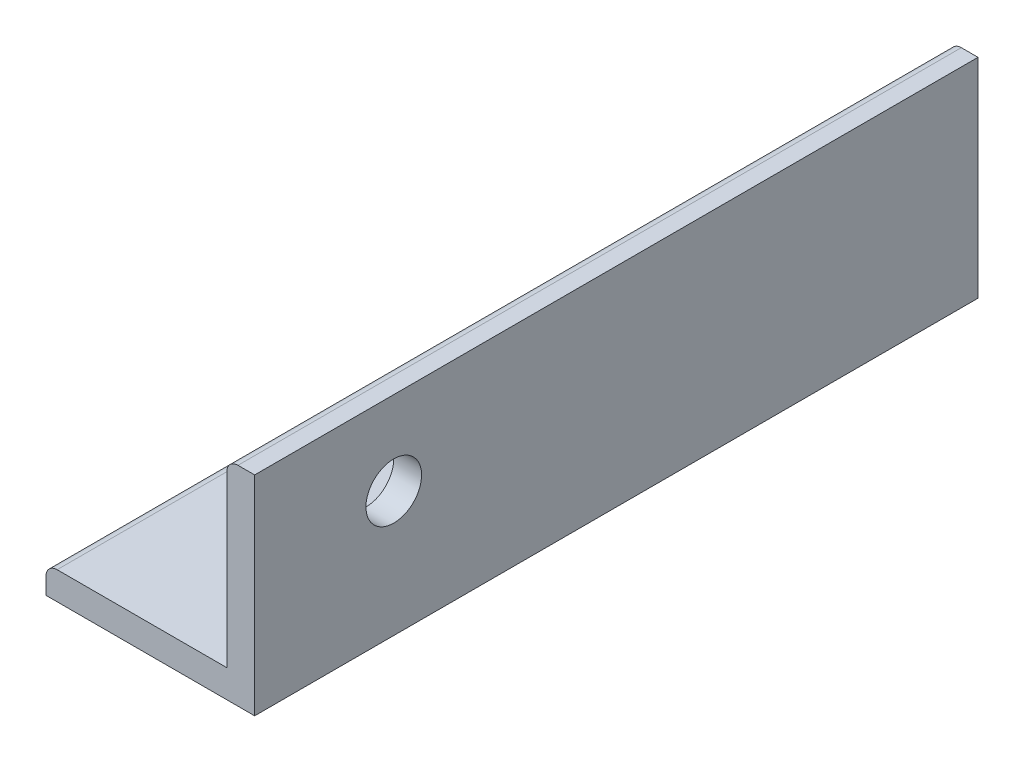
ISO-10303-21;
HEADER;
FILE_DESCRIPTION(('STEP AP214'),'2;1');
FILE_NAME('part.step','',(''),(''),'','','');
FILE_SCHEMA(('AUTOMOTIVE_DESIGN { 1 0 10303 214 1 1 1 1 }'));
ENDSEC;
DATA;
#1=APPLICATION_CONTEXT('core data for automotive mechanical design processes');
#2=APPLICATION_PROTOCOL_DEFINITION('international standard','automotive_design',2000,#1);
#3=PRODUCT_CONTEXT('',#1,'mechanical');
#4=PRODUCT('Part','Part','',(#3));
#5=PRODUCT_RELATED_PRODUCT_CATEGORY('part','',(#4));
#6=PRODUCT_DEFINITION_FORMATION('','',#4);
#7=PRODUCT_DEFINITION_CONTEXT('part definition',#1,'design');
#8=PRODUCT_DEFINITION('design','',#6,#7);
#9=PRODUCT_DEFINITION_SHAPE('','',#8);
#10=(LENGTH_UNIT() NAMED_UNIT(*) SI_UNIT(.MILLI.,.METRE.));
#11=(NAMED_UNIT(*) PLANE_ANGLE_UNIT() SI_UNIT($,.RADIAN.));
#12=(NAMED_UNIT(*) SI_UNIT($,.STERADIAN.) SOLID_ANGLE_UNIT());
#13=UNCERTAINTY_MEASURE_WITH_UNIT(LENGTH_MEASURE(1.E-05),#10,'distance_accuracy_value','');
#14=(GEOMETRIC_REPRESENTATION_CONTEXT(3) GLOBAL_UNCERTAINTY_ASSIGNED_CONTEXT((#13)) GLOBAL_UNIT_ASSIGNED_CONTEXT((#10,
#11,#12)) REPRESENTATION_CONTEXT('',''));
#15=CARTESIAN_POINT('',(0.,0.,0.));
#16=DIRECTION('',(0.,0.,1.));
#17=DIRECTION('',(1.,0.,0.));
#18=AXIS2_PLACEMENT_3D('',#15,#16,#17);
#19=CARTESIAN_POINT('',(0.,0.,52.));
#20=DIRECTION('',(0.,1.,0.));
#21=DIRECTION('',(-1.,0.,0.));
#22=AXIS2_PLACEMENT_3D('',#19,#20,#21);
#23=PLANE('',#22);
#24=DIRECTION('',(1.,0.,0.));
#25=VECTOR('',#24,1.);
#26=CARTESIAN_POINT('',(0.,0.,0.));
#27=LINE('',#26,#25);
#28=CARTESIAN_POINT('',(-15.,0.,0.));
#29=VERTEX_POINT('',#28);
#30=CARTESIAN_POINT('',(0.,0.,0.));
#31=VERTEX_POINT('',#30);
#32=EDGE_CURVE('E122',#29,#31,#27,.T.);
#33=ORIENTED_EDGE('',*,*,#32,.T.);
#34=DIRECTION('',(0.,0.,-1.));
#35=VECTOR('',#34,1.);
#36=CARTESIAN_POINT('',(0.,0.,52.));
#37=LINE('',#36,#35);
#38=CARTESIAN_POINT('',(0.,0.,52.));
#39=VERTEX_POINT('',#38);
#40=EDGE_CURVE('E104',#39,#31,#37,.T.);
#41=ORIENTED_EDGE('',*,*,#40,.F.);
#42=DIRECTION('',(1.,0.,0.));
#43=VECTOR('',#42,1.);
#44=CARTESIAN_POINT('',(0.,0.,52.));
#45=LINE('',#44,#43);
#46=CARTESIAN_POINT('',(-15.,0.,52.));
#47=VERTEX_POINT('',#46);
#48=EDGE_CURVE('E109',#47,#39,#45,.T.);
#49=ORIENTED_EDGE('',*,*,#48,.F.);
#50=DIRECTION('',(0.,0.,-1.));
#51=VECTOR('',#50,1.);
#52=CARTESIAN_POINT('',(-15.,0.,52.));
#53=LINE('',#52,#51);
#54=EDGE_CURVE('E164',#47,#29,#53,.T.);
#55=ORIENTED_EDGE('',*,*,#54,.T.);
#56=EDGE_LOOP('',(#33,#41,#49,#55));
#57=FACE_BOUND('',#56,.T.);
#58=ADVANCED_FACE('F35',(#57),#23,.F.);
#59=CARTESIAN_POINT('',(0.,0.,52.));
#60=DIRECTION('',(-1.,0.,0.));
#61=DIRECTION('',(0.,0.,1.));
#62=AXIS2_PLACEMENT_3D('',#59,#60,#61);
#63=PLANE('',#62);
#64=CARTESIAN_POINT('',(0.,9.,42.));
#65=DIRECTION('',(-1.,0.,0.));
#66=DIRECTION('',(0.,-1.,0.));
#67=AXIS2_PLACEMENT_3D('',#64,#65,#66);
#68=CIRCLE('',#67,2.);
#69=CARTESIAN_POINT('',(0.,7.,42.));
#70=VERTEX_POINT('',#69);
#71=EDGE_CURVE('E176',#70,#70,#68,.T.);
#72=ORIENTED_EDGE('',*,*,#71,.T.);
#73=EDGE_LOOP('',(#72));
#74=FACE_BOUND('',#73,.T.);
#75=DIRECTION('',(0.,1.,0.));
#76=VECTOR('',#75,1.);
#77=CARTESIAN_POINT('',(0.,0.,0.));
#78=LINE('',#77,#76);
#79=CARTESIAN_POINT('',(0.,15.,0.));
#80=VERTEX_POINT('',#79);
#81=EDGE_CURVE('E159',#31,#80,#78,.T.);
#82=ORIENTED_EDGE('',*,*,#81,.T.);
#83=DIRECTION('',(0.,0.,-1.));
#84=VECTOR('',#83,1.);
#85=CARTESIAN_POINT('',(0.,15.,52.));
#86=LINE('',#85,#84);
#87=CARTESIAN_POINT('',(0.,15.,52.));
#88=VERTEX_POINT('',#87);
#89=EDGE_CURVE('E107',#88,#80,#86,.T.);
#90=ORIENTED_EDGE('',*,*,#89,.F.);
#91=DIRECTION('',(0.,1.,0.));
#92=VECTOR('',#91,1.);
#93=CARTESIAN_POINT('',(0.,0.,52.));
#94=LINE('',#93,#92);
#95=EDGE_CURVE('E100',#39,#88,#94,.T.);
#96=ORIENTED_EDGE('',*,*,#95,.F.);
#97=ORIENTED_EDGE('',*,*,#40,.T.);
#98=EDGE_LOOP('',(#82,#90,#96,#97));
#99=FACE_BOUND('',#98,.T.);
#100=ADVANCED_FACE('F102',(#74,#99),#63,.F.);
#101=CARTESIAN_POINT('',(0.,15.,52.));
#102=DIRECTION('',(0.,-1.,0.));
#103=DIRECTION('',(0.,0.,-1.));
#104=AXIS2_PLACEMENT_3D('',#101,#102,#103);
#105=PLANE('',#104);
#106=DIRECTION('',(-1.,0.,0.));
#107=VECTOR('',#106,1.);
#108=CARTESIAN_POINT('',(0.,15.,0.));
#109=LINE('',#108,#107);
#110=CARTESIAN_POINT('',(-1.2,15.,0.));
#111=VERTEX_POINT('',#110);
#112=EDGE_CURVE('E156',#80,#111,#109,.T.);
#113=ORIENTED_EDGE('',*,*,#112,.T.);
#114=DIRECTION('',(0.,0.,-1.));
#115=VECTOR('',#114,1.);
#116=CARTESIAN_POINT('',(-1.2,15.,52.));
#117=LINE('',#116,#115);
#118=CARTESIAN_POINT('',(-1.2,15.,52.));
#119=VERTEX_POINT('',#118);
#120=EDGE_CURVE('E11',#111,#119,#117,.F.);
#121=ORIENTED_EDGE('',*,*,#120,.T.);
#122=DIRECTION('',(-1.,0.,0.));
#123=VECTOR('',#122,1.);
#124=CARTESIAN_POINT('',(0.,15.,52.));
#125=LINE('',#124,#123);
#126=EDGE_CURVE('E108',#88,#119,#125,.T.);
#127=ORIENTED_EDGE('',*,*,#126,.F.);
#128=ORIENTED_EDGE('',*,*,#89,.T.);
#129=EDGE_LOOP('',(#113,#121,#127,#128));
#130=FACE_BOUND('',#129,.T.);
#131=ADVANCED_FACE('F177',(#130),#105,.F.);
#132=CARTESIAN_POINT('',(-2.,15.,52.));
#133=DIRECTION('',(1.,0.,0.));
#134=DIRECTION('',(0.,1.,0.));
#135=AXIS2_PLACEMENT_3D('',#132,#133,#134);
#136=PLANE('',#135);
#137=CARTESIAN_POINT('',(-2.,9.,42.));
#138=DIRECTION('',(-1.,0.,0.));
#139=DIRECTION('',(0.,-1.,0.));
#140=AXIS2_PLACEMENT_3D('',#137,#138,#139);
#141=CIRCLE('',#140,2.);
#142=CARTESIAN_POINT('',(-2.,7.,42.));
#143=VERTEX_POINT('',#142);
#144=EDGE_CURVE('E179',#143,#143,#141,.T.);
#145=ORIENTED_EDGE('',*,*,#144,.F.);
#146=EDGE_LOOP('',(#145));
#147=FACE_BOUND('',#146,.T.);
#148=DIRECTION('',(0.,-1.,0.));
#149=VECTOR('',#148,1.);
#150=CARTESIAN_POINT('',(-2.,15.,52.));
#151=LINE('',#150,#149);
#152=CARTESIAN_POINT('',(-2.,14.2,52.));
#153=VERTEX_POINT('',#152);
#154=CARTESIAN_POINT('',(-2.,2.,52.));
#155=VERTEX_POINT('',#154);
#156=EDGE_CURVE('E147',#153,#155,#151,.T.);
#157=ORIENTED_EDGE('',*,*,#156,.F.);
#158=DIRECTION('',(0.,0.,-1.));
#159=VECTOR('',#158,1.);
#160=CARTESIAN_POINT('',(-2.,14.2,52.));
#161=LINE('',#160,#159);
#162=CARTESIAN_POINT('',(-2.,14.2,0.));
#163=VERTEX_POINT('',#162);
#164=EDGE_CURVE('E43',#153,#163,#161,.T.);
#165=ORIENTED_EDGE('',*,*,#164,.T.);
#166=DIRECTION('',(0.,-1.,0.));
#167=VECTOR('',#166,1.);
#168=CARTESIAN_POINT('',(-2.,15.,0.));
#169=LINE('',#168,#167);
#170=CARTESIAN_POINT('',(-2.,2.,0.));
#171=VERTEX_POINT('',#170);
#172=EDGE_CURVE('E145',#163,#171,#169,.T.);
#173=ORIENTED_EDGE('',*,*,#172,.T.);
#174=DIRECTION('',(0.,0.,-1.));
#175=VECTOR('',#174,1.);
#176=CARTESIAN_POINT('',(-2.,2.,52.));
#177=LINE('',#176,#175);
#178=EDGE_CURVE('E128',#155,#171,#177,.T.);
#179=ORIENTED_EDGE('',*,*,#178,.F.);
#180=EDGE_LOOP('',(#157,#165,#173,#179));
#181=FACE_BOUND('',#180,.T.);
#182=ADVANCED_FACE('F143',(#147,#181),#136,.F.);
#183=CARTESIAN_POINT('',(-15.,2.,52.));
#184=DIRECTION('',(0.,-1.,0.));
#185=DIRECTION('',(0.,0.,-1.));
#186=AXIS2_PLACEMENT_3D('',#183,#184,#185);
#187=PLANE('',#186);
#188=DIRECTION('',(-1.,0.,0.));
#189=VECTOR('',#188,1.);
#190=CARTESIAN_POINT('',(-15.,2.,0.));
#191=LINE('',#190,#189);
#192=CARTESIAN_POINT('',(-14.2,2.,0.));
#193=VERTEX_POINT('',#192);
#194=EDGE_CURVE('E155',#171,#193,#191,.T.);
#195=ORIENTED_EDGE('',*,*,#194,.T.);
#196=DIRECTION('',(0.,0.,-1.));
#197=VECTOR('',#196,1.);
#198=CARTESIAN_POINT('',(-14.2,2.,52.));
#199=LINE('',#198,#197);
#200=CARTESIAN_POINT('',(-14.2,2.,52.));
#201=VERTEX_POINT('',#200);
#202=EDGE_CURVE('E135',#193,#201,#199,.F.);
#203=ORIENTED_EDGE('',*,*,#202,.T.);
#204=DIRECTION('',(-1.,0.,0.));
#205=VECTOR('',#204,1.);
#206=CARTESIAN_POINT('',(-15.,2.,52.));
#207=LINE('',#206,#205);
#208=EDGE_CURVE('E169',#155,#201,#207,.T.);
#209=ORIENTED_EDGE('',*,*,#208,.F.);
#210=ORIENTED_EDGE('',*,*,#178,.T.);
#211=EDGE_LOOP('',(#195,#203,#209,#210));
#212=FACE_BOUND('',#211,.T.);
#213=ADVANCED_FACE('F167',(#212),#187,.F.);
#214=CARTESIAN_POINT('',(-15.,0.,52.));
#215=DIRECTION('',(1.,0.,0.));
#216=DIRECTION('',(0.,0.,-1.));
#217=AXIS2_PLACEMENT_3D('',#214,#215,#216);
#218=PLANE('',#217);
#219=DIRECTION('',(0.,-1.,0.));
#220=VECTOR('',#219,1.);
#221=CARTESIAN_POINT('',(-15.,0.,52.));
#222=LINE('',#221,#220);
#223=CARTESIAN_POINT('',(-15.,1.2,52.));
#224=VERTEX_POINT('',#223);
#225=EDGE_CURVE('E115',#224,#47,#222,.T.);
#226=ORIENTED_EDGE('',*,*,#225,.F.);
#227=DIRECTION('',(0.,0.,-1.));
#228=VECTOR('',#227,1.);
#229=CARTESIAN_POINT('',(-15.,1.2,52.));
#230=LINE('',#229,#228);
#231=CARTESIAN_POINT('',(-15.,1.2,0.));
#232=VERTEX_POINT('',#231);
#233=EDGE_CURVE('E123',#224,#232,#230,.T.);
#234=ORIENTED_EDGE('',*,*,#233,.T.);
#235=DIRECTION('',(0.,-1.,0.));
#236=VECTOR('',#235,1.);
#237=CARTESIAN_POINT('',(-15.,0.,0.));
#238=LINE('',#237,#236);
#239=EDGE_CURVE('E119',#232,#29,#238,.T.);
#240=ORIENTED_EDGE('',*,*,#239,.T.);
#241=ORIENTED_EDGE('',*,*,#54,.F.);
#242=EDGE_LOOP('',(#226,#234,#240,#241));
#243=FACE_BOUND('',#242,.T.);
#244=ADVANCED_FACE('F198',(#243),#218,.F.);
#245=CARTESIAN_POINT('',(0.,0.,52.));
#246=DIRECTION('',(0.,0.,-1.));
#247=DIRECTION('',(-1.,0.,0.));
#248=AXIS2_PLACEMENT_3D('',#245,#246,#247);
#249=PLANE('',#248);
#250=ORIENTED_EDGE('',*,*,#208,.T.);
#251=CARTESIAN_POINT('',(-14.2,1.2,52.));
#252=DIRECTION('',(0.,0.,-1.));
#253=DIRECTION('',(-1.,0.,0.));
#254=AXIS2_PLACEMENT_3D('',#251,#252,#253);
#255=CIRCLE('',#254,0.8);
#256=EDGE_CURVE('E138',#201,#224,#255,.F.);
#257=ORIENTED_EDGE('',*,*,#256,.T.);
#258=ORIENTED_EDGE('',*,*,#225,.T.);
#259=ORIENTED_EDGE('',*,*,#48,.T.);
#260=ORIENTED_EDGE('',*,*,#95,.T.);
#261=ORIENTED_EDGE('',*,*,#126,.T.);
#262=CARTESIAN_POINT('',(-1.2,14.2,52.));
#263=DIRECTION('',(0.,0.,-1.));
#264=DIRECTION('',(-1.,0.,0.));
#265=AXIS2_PLACEMENT_3D('',#262,#263,#264);
#266=CIRCLE('',#265,0.8);
#267=EDGE_CURVE('E50',#119,#153,#266,.F.);
#268=ORIENTED_EDGE('',*,*,#267,.T.);
#269=ORIENTED_EDGE('',*,*,#156,.T.);
#270=EDGE_LOOP('',(#250,#257,#258,#259,#260,#261,#268,#269));
#271=FACE_BOUND('',#270,.T.);
#272=ADVANCED_FACE('F113',(#271),#249,.F.);
#273=CARTESIAN_POINT('',(0.,0.,0.));
#274=DIRECTION('',(0.,0.,-1.));
#275=DIRECTION('',(-1.,0.,0.));
#276=AXIS2_PLACEMENT_3D('',#273,#274,#275);
#277=PLANE('',#276);
#278=ORIENTED_EDGE('',*,*,#239,.F.);
#279=CARTESIAN_POINT('',(-14.2,1.2,0.));
#280=DIRECTION('',(0.,0.,-1.));
#281=DIRECTION('',(-1.,0.,0.));
#282=AXIS2_PLACEMENT_3D('',#279,#280,#281);
#283=CIRCLE('',#282,0.8);
#284=EDGE_CURVE('E133',#232,#193,#283,.T.);
#285=ORIENTED_EDGE('',*,*,#284,.T.);
#286=ORIENTED_EDGE('',*,*,#194,.F.);
#287=ORIENTED_EDGE('',*,*,#172,.F.);
#288=CARTESIAN_POINT('',(-1.2,14.2,0.));
#289=DIRECTION('',(0.,0.,-1.));
#290=DIRECTION('',(-1.,0.,0.));
#291=AXIS2_PLACEMENT_3D('',#288,#289,#290);
#292=CIRCLE('',#291,0.8);
#293=EDGE_CURVE('E126',#163,#111,#292,.T.);
#294=ORIENTED_EDGE('',*,*,#293,.T.);
#295=ORIENTED_EDGE('',*,*,#112,.F.);
#296=ORIENTED_EDGE('',*,*,#81,.F.);
#297=ORIENTED_EDGE('',*,*,#32,.F.);
#298=EDGE_LOOP('',(#278,#285,#286,#287,#294,#295,#296,#297));
#299=FACE_BOUND('',#298,.T.);
#300=ADVANCED_FACE('F152',(#299),#277,.T.);
#301=CARTESIAN_POINT('',(-14.2,1.2,52.));
#302=DIRECTION('',(0.,0.,-1.));
#303=DIRECTION('',(-1.,0.,0.));
#304=AXIS2_PLACEMENT_3D('',#301,#302,#303);
#305=CYLINDRICAL_SURFACE('',#304,0.8);
#306=ORIENTED_EDGE('',*,*,#256,.F.);
#307=ORIENTED_EDGE('',*,*,#202,.F.);
#308=ORIENTED_EDGE('',*,*,#284,.F.);
#309=ORIENTED_EDGE('',*,*,#233,.F.);
#310=EDGE_LOOP('',(#306,#307,#308,#309));
#311=FACE_BOUND('',#310,.T.);
#312=ADVANCED_FACE('F207',(#311),#305,.T.);
#313=CARTESIAN_POINT('',(-1.2,14.2,52.));
#314=DIRECTION('',(0.,0.,-1.));
#315=DIRECTION('',(-1.,0.,0.));
#316=AXIS2_PLACEMENT_3D('',#313,#314,#315);
#317=CYLINDRICAL_SURFACE('',#316,0.8);
#318=ORIENTED_EDGE('',*,*,#267,.F.);
#319=ORIENTED_EDGE('',*,*,#120,.F.);
#320=ORIENTED_EDGE('',*,*,#293,.F.);
#321=ORIENTED_EDGE('',*,*,#164,.F.);
#322=EDGE_LOOP('',(#318,#319,#320,#321));
#323=FACE_BOUND('',#322,.T.);
#324=ADVANCED_FACE('F37',(#323),#317,.T.);
#325=CARTESIAN_POINT('',(0.,9.,42.));
#326=DIRECTION('',(-1.,0.,0.));
#327=DIRECTION('',(0.,-1.,0.));
#328=AXIS2_PLACEMENT_3D('',#325,#326,#327);
#329=CYLINDRICAL_SURFACE('',#328,2.);
#330=ORIENTED_EDGE('',*,*,#71,.F.);
#331=EDGE_LOOP('',(#330));
#332=FACE_BOUND('',#331,.T.);
#333=ORIENTED_EDGE('',*,*,#144,.T.);
#334=EDGE_LOOP('',(#333));
#335=FACE_BOUND('',#334,.T.);
#336=ADVANCED_FACE('F186',(#332,#335),#329,.F.);
#337=CLOSED_SHELL('',(#58,#100,#131,#182,#213,#244,#272,#300,#312,#324,#336));
#338=MANIFOLD_SOLID_BREP('B2',#337);
#339=ADVANCED_BREP_SHAPE_REPRESENTATION('',(#18,#338),#14);
#340=SHAPE_DEFINITION_REPRESENTATION(#9,#339);
ENDSEC;
END-ISO-10303-21;
